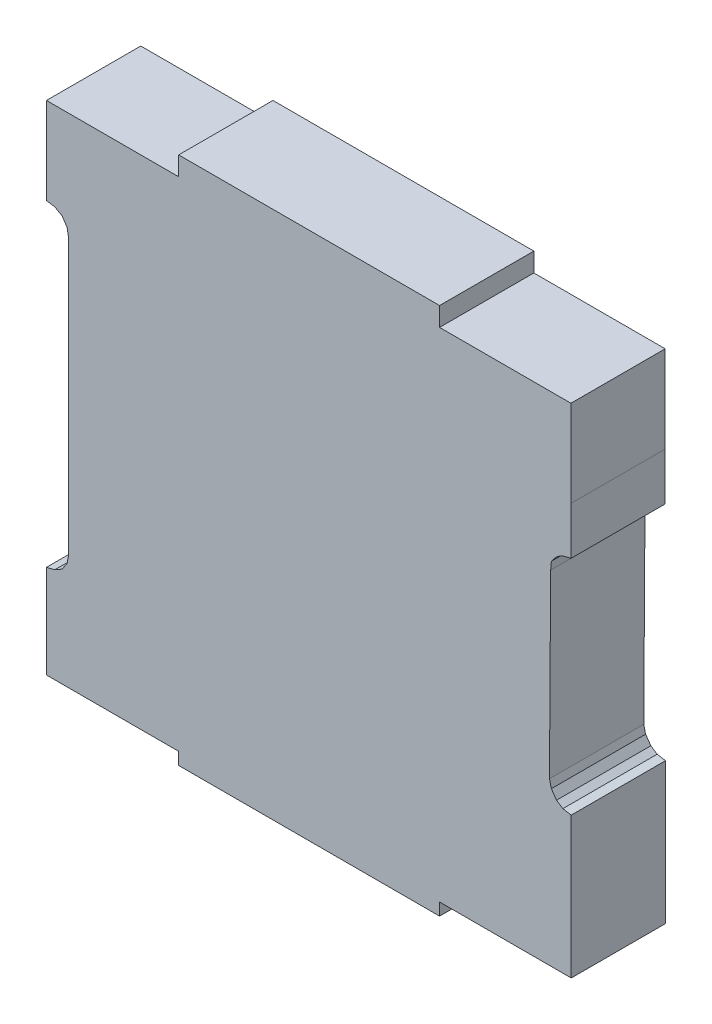
ISO-10303-21;
HEADER;
FILE_DESCRIPTION(('STEP AP214'),'2;1');
FILE_NAME('part.step','',(''),(''),'','','');
FILE_SCHEMA(('AUTOMOTIVE_DESIGN { 1 0 10303 214 1 1 1 1 }'));
ENDSEC;
DATA;
#1=APPLICATION_CONTEXT('core data for automotive mechanical design processes');
#2=APPLICATION_PROTOCOL_DEFINITION('international standard','automotive_design',2000,#1);
#3=PRODUCT_CONTEXT('',#1,'mechanical');
#4=PRODUCT('Part','Part','',(#3));
#5=PRODUCT_RELATED_PRODUCT_CATEGORY('part','',(#4));
#6=PRODUCT_DEFINITION_FORMATION('','',#4);
#7=PRODUCT_DEFINITION_CONTEXT('part definition',#1,'design');
#8=PRODUCT_DEFINITION('design','',#6,#7);
#9=PRODUCT_DEFINITION_SHAPE('','',#8);
#10=(LENGTH_UNIT() NAMED_UNIT(*) SI_UNIT(.MILLI.,.METRE.));
#11=(NAMED_UNIT(*) PLANE_ANGLE_UNIT() SI_UNIT($,.RADIAN.));
#12=(NAMED_UNIT(*) SI_UNIT($,.STERADIAN.) SOLID_ANGLE_UNIT());
#13=UNCERTAINTY_MEASURE_WITH_UNIT(LENGTH_MEASURE(1.E-05),#10,'distance_accuracy_value','');
#14=(GEOMETRIC_REPRESENTATION_CONTEXT(3) GLOBAL_UNCERTAINTY_ASSIGNED_CONTEXT((#13)) GLOBAL_UNIT_ASSIGNED_CONTEXT((#10,
#11,#12)) REPRESENTATION_CONTEXT('',''));
#15=CARTESIAN_POINT('',(0.,0.,0.));
#16=DIRECTION('',(0.,0.,1.));
#17=DIRECTION('',(1.,0.,0.));
#18=AXIS2_PLACEMENT_3D('',#15,#16,#17);
#19=CARTESIAN_POINT('',(0.004072147089888,-0.003966763394403,0.4499991));
#20=DIRECTION('',(0.,0.,-1.));
#21=DIRECTION('',(0.,-1.,0.));
#22=AXIS2_PLACEMENT_3D('',#19,#20,#21);
#23=PLANE('',#22);
#24=DIRECTION('',(0.,1.,0.));
#25=VECTOR('',#24,1.);
#26=CARTESIAN_POINT('',(-1.25230636,0.75731116,0.4499991));
#27=LINE('',#26,#25);
#28=CARTESIAN_POINT('',(-1.25230636,0.75731116,0.4499991));
#29=VERTEX_POINT('',#28);
#30=CARTESIAN_POINT('',(-1.25230636,1.17155214,0.4499991));
#31=VERTEX_POINT('',#30);
#32=EDGE_CURVE('E331',#29,#31,#27,.T.);
#33=ORIENTED_EDGE('',*,*,#32,.F.);
#34=DIRECTION('',(-0.989600074285648,0.143846073890949,0.));
#35=VECTOR('',#34,1.);
#36=CARTESIAN_POINT('',(-1.21269252,0.75155298,0.4499991));
#37=LINE('',#36,#35);
#38=CARTESIAN_POINT('',(-1.21269252,0.75155298,0.4499991));
#39=VERTEX_POINT('',#38);
#40=EDGE_CURVE('E26',#39,#29,#37,.T.);
#41=ORIENTED_EDGE('',*,*,#40,.F.);
#42=DIRECTION('',(-0.868266404406889,0.496098227146936,0.));
#43=VECTOR('',#42,1.);
#44=CARTESIAN_POINT('',(-1.17768878,0.73155302,0.4499991));
#45=LINE('',#44,#43);
#46=CARTESIAN_POINT('',(-1.17768878,0.73155302,0.4499991));
#47=VERTEX_POINT('',#46);
#48=EDGE_CURVE('E363',#47,#39,#45,.T.);
#49=ORIENTED_EDGE('',*,*,#48,.F.);
#50=DIRECTION('',(-0.558445686994025,0.829541086793036,0.));
#51=VECTOR('',#50,1.);
#52=CARTESIAN_POINT('',(-1.15412774,0.69655436,0.4499991));
#53=LINE('',#52,#51);
#54=CARTESIAN_POINT('',(-1.15412774,0.69655436,0.4499991));
#55=VERTEX_POINT('',#54);
#56=EDGE_CURVE('E626',#55,#47,#53,.T.);
#57=ORIENTED_EDGE('',*,*,#56,.F.);
#58=DIRECTION('',(-0.180813600571943,0.983517382585692,0.));
#59=VECTOR('',#58,1.);
#60=CARTESIAN_POINT('',(-1.14702336,0.6579108,0.4499991));
#61=LINE('',#60,#59);
#62=CARTESIAN_POINT('',(-1.14702336,0.6579108,0.4499991));
#63=VERTEX_POINT('',#62);
#64=EDGE_CURVE('E374',#63,#55,#61,.T.);
#65=ORIENTED_EDGE('',*,*,#64,.F.);
#66=DIRECTION('',(-1.73969183810043E-05,0.999999999848674,0.));
#67=VECTOR('',#66,1.);
#68=CARTESIAN_POINT('',(-1.1470005,-0.65611502,0.4499991));
#69=LINE('',#68,#67);
#70=CARTESIAN_POINT('',(-1.1470005,-0.65611502,0.4499991));
#71=VERTEX_POINT('',#70);
#72=EDGE_CURVE('E834',#71,#63,#69,.T.);
#73=ORIENTED_EDGE('',*,*,#72,.F.);
#74=DIRECTION('',(0.187535908039033,0.982257747842172,0.));
#75=VECTOR('',#74,1.);
#76=CARTESIAN_POINT('',(-1.15412774,-0.6934454,0.4499991));
#77=LINE('',#76,#75);
#78=CARTESIAN_POINT('',(-1.15412774,-0.6934454,0.4499991));
#79=VERTEX_POINT('',#78);
#80=EDGE_CURVE('E406',#79,#71,#77,.T.);
#81=ORIENTED_EDGE('',*,*,#80,.F.);
#82=DIRECTION('',(0.558431338237087,0.829550746172129,0.));
#83=VECTOR('',#82,1.);
#84=CARTESIAN_POINT('',(-1.17769132,-0.72844914,0.4499991));
#85=LINE('',#84,#83);
#86=CARTESIAN_POINT('',(-1.17769132,-0.72844914,0.4499991));
#87=VERTEX_POINT('',#86);
#88=EDGE_CURVE('E476',#87,#79,#85,.T.);
#89=ORIENTED_EDGE('',*,*,#88,.F.);
#90=DIRECTION('',(0.868278037832248,0.496077865882142,0.));
#91=VECTOR('',#90,1.);
#92=CARTESIAN_POINT('',(-1.21269252,-0.74844656,0.4499991));
#93=LINE('',#92,#91);
#94=CARTESIAN_POINT('',(-1.21269252,-0.74844656,0.4499991));
#95=VERTEX_POINT('',#94);
#96=EDGE_CURVE('E289',#95,#87,#93,.T.);
#97=ORIENTED_EDGE('',*,*,#96,.F.);
#98=DIRECTION('',(0.971000649625599,0.239076846278901,0.));
#99=VECTOR('',#98,1.);
#100=CARTESIAN_POINT('',(-1.25230636,-0.75820016,0.4499991));
#101=LINE('',#100,#99);
#102=CARTESIAN_POINT('',(-1.25230636,-0.75820016,0.4499991));
#103=VERTEX_POINT('',#102);
#104=EDGE_CURVE('E282',#103,#95,#101,.T.);
#105=ORIENTED_EDGE('',*,*,#104,.F.);
#106=DIRECTION('',(0.,1.,0.));
#107=VECTOR('',#106,1.);
#108=CARTESIAN_POINT('',(-1.25230636,-1.20344692,0.4499991));
#109=LINE('',#108,#107);
#110=CARTESIAN_POINT('',(-1.25230636,-1.20344692,0.4499991));
#111=VERTEX_POINT('',#110);
#112=EDGE_CURVE('E286',#111,#103,#109,.T.);
#113=ORIENTED_EDGE('',*,*,#112,.F.);
#114=DIRECTION('',(-1.,0.,0.));
#115=VECTOR('',#114,1.);
#116=CARTESIAN_POINT('',(-0.6213221,-1.20344692,0.4499991));
#117=LINE('',#116,#115);
#118=CARTESIAN_POINT('',(-0.6213221,-1.20344692,0.4499991));
#119=VERTEX_POINT('',#118);
#120=EDGE_CURVE('E375',#119,#111,#117,.T.);
#121=ORIENTED_EDGE('',*,*,#120,.F.);
#122=DIRECTION('',(0.,1.,0.));
#123=VECTOR('',#122,1.);
#124=CARTESIAN_POINT('',(-0.6213221,-1.26197106,0.4499991));
#125=LINE('',#124,#123);
#126=CARTESIAN_POINT('',(-0.6213221,-1.26197106,0.4499991));
#127=VERTEX_POINT('',#126);
#128=EDGE_CURVE('E458',#127,#119,#125,.T.);
#129=ORIENTED_EDGE('',*,*,#128,.F.);
#130=DIRECTION('',(-1.,0.,0.));
#131=VECTOR('',#130,1.);
#132=CARTESIAN_POINT('',(0.62387988,-1.26197106,0.4499991));
#133=LINE('',#132,#131);
#134=CARTESIAN_POINT('',(0.62387988,-1.26197106,0.4499991));
#135=VERTEX_POINT('',#134);
#136=EDGE_CURVE('E347',#135,#127,#133,.T.);
#137=ORIENTED_EDGE('',*,*,#136,.F.);
#138=DIRECTION('',(0.,-1.,0.));
#139=VECTOR('',#138,1.);
#140=CARTESIAN_POINT('',(0.62387988,-1.20344692,0.4499991));
#141=LINE('',#140,#139);
#142=CARTESIAN_POINT('',(0.62387988,-1.20344692,0.4499991));
#143=VERTEX_POINT('',#142);
#144=EDGE_CURVE('E541',#143,#135,#141,.T.);
#145=ORIENTED_EDGE('',*,*,#144,.F.);
#146=DIRECTION('',(-1.,0.,0.));
#147=VECTOR('',#146,1.);
#148=CARTESIAN_POINT('',(1.2523089,-1.20344692,0.4499991));
#149=LINE('',#148,#147);
#150=CARTESIAN_POINT('',(1.2523089,-1.20344692,0.4499991));
#151=VERTEX_POINT('',#150);
#152=EDGE_CURVE('E426',#151,#143,#149,.T.);
#153=ORIENTED_EDGE('',*,*,#152,.F.);
#154=DIRECTION('',(0.,-1.,0.));
#155=VECTOR('',#154,1.);
#156=CARTESIAN_POINT('',(1.2523089,-0.53015388,0.4499991));
#157=LINE('',#156,#155);
#158=CARTESIAN_POINT('',(1.2523089,-0.53015388,0.4499991));
#159=VERTEX_POINT('',#158);
#160=EDGE_CURVE('E470',#159,#151,#157,.T.);
#161=ORIENTED_EDGE('',*,*,#160,.F.);
#162=DIRECTION('',(0.986227548607137,-0.165394142485023,0.));
#163=VECTOR('',#162,1.);
#164=CARTESIAN_POINT('',(1.21230898,-0.52344574,0.4499991));
#165=LINE('',#164,#163);
#166=CARTESIAN_POINT('',(1.21230898,-0.52344574,0.4499991));
#167=VERTEX_POINT('',#166);
#168=EDGE_CURVE('E388',#167,#159,#165,.T.);
#169=ORIENTED_EDGE('',*,*,#168,.F.);
#170=DIRECTION('',(0.832050294337228,-0.554700196226152,0.));
#171=VECTOR('',#170,1.);
#172=CARTESIAN_POINT('',(1.18230904,-0.50344578,0.4499991));
#173=LINE('',#172,#171);
#174=CARTESIAN_POINT('',(1.18230904,-0.50344578,0.4499991));
#175=VERTEX_POINT('',#174);
#176=EDGE_CURVE('E453',#175,#167,#173,.T.);
#177=ORIENTED_EDGE('',*,*,#176,.F.);
#178=DIRECTION('',(0.58064041417209,-0.814160125178127,0.));
#179=VECTOR('',#178,1.);
#180=CARTESIAN_POINT('',(1.15733068,-0.46842172,0.4499991));
#181=LINE('',#180,#179);
#182=CARTESIAN_POINT('',(1.15733068,-0.46842172,0.4499991));
#183=VERTEX_POINT('',#182);
#184=EDGE_CURVE('E575',#183,#175,#181,.T.);
#185=ORIENTED_EDGE('',*,*,#184,.F.);
#186=DIRECTION('',(0.237317060096085,-0.971432248274346,0.));
#187=VECTOR('',#186,1.);
#188=CARTESIAN_POINT('',(1.1484102,-0.43190668,0.4499991));
#189=LINE('',#188,#187);
#190=CARTESIAN_POINT('',(1.1484102,-0.43190668,0.4499991));
#191=VERTEX_POINT('',#190);
#192=EDGE_CURVE('E432',#191,#183,#189,.T.);
#193=ORIENTED_EDGE('',*,*,#192,.F.);
#194=DIRECTION('',(-0.00650451927293341,-0.999978845390755,0.));
#195=VECTOR('',#194,1.);
#196=CARTESIAN_POINT('',(1.15403884,0.43341798,0.4499991));
#197=LINE('',#196,#195);
#198=CARTESIAN_POINT('',(1.15403884,0.43341798,0.4499991));
#199=VERTEX_POINT('',#198);
#200=EDGE_CURVE('E481',#199,#191,#197,.T.);
#201=ORIENTED_EDGE('',*,*,#200,.F.);
#202=DIRECTION('',(-0.085401141345704,-0.996346649041814,0.));
#203=VECTOR('',#202,1.);
#204=CARTESIAN_POINT('',(1.15730782,0.47155608,0.4499991));
#205=LINE('',#204,#203);
#206=CARTESIAN_POINT('',(1.15730782,0.47155608,0.4499991));
#207=VERTEX_POINT('',#206);
#208=EDGE_CURVE('E525',#207,#199,#205,.T.);
#209=ORIENTED_EDGE('',*,*,#208,.F.);
#210=DIRECTION('',(-0.600081281194105,-0.79993903265214,0.));
#211=VECTOR('',#210,1.);
#212=CARTESIAN_POINT('',(1.17230906,0.4915535,0.4499991));
#213=LINE('',#212,#211);
#214=CARTESIAN_POINT('',(1.17230906,0.4915535,0.4499991));
#215=VERTEX_POINT('',#214);
#216=EDGE_CURVE('E321',#215,#207,#213,.T.);
#217=ORIENTED_EDGE('',*,*,#216,.F.);
#218=DIRECTION('',(-0.707106781188048,-0.707106781185048,0.));
#219=VECTOR('',#218,1.);
#220=CARTESIAN_POINT('',(1.18730776,0.5065522,0.4499991));
#221=LINE('',#220,#219);
#222=CARTESIAN_POINT('',(1.18730776,0.5065522,0.4499991));
#223=VERTEX_POINT('',#222);
#224=EDGE_CURVE('E540',#223,#215,#221,.T.);
#225=ORIENTED_EDGE('',*,*,#224,.F.);
#226=DIRECTION('',(-0.857485238888372,-0.514508566584223,0.));
#227=VECTOR('',#226,1.);
#228=CARTESIAN_POINT('',(1.21230898,0.52155344,0.4499991));
#229=LINE('',#228,#227);
#230=CARTESIAN_POINT('',(1.21230898,0.52155344,0.4499991));
#231=VERTEX_POINT('',#230);
#232=EDGE_CURVE('E337',#231,#223,#229,.T.);
#233=ORIENTED_EDGE('',*,*,#232,.F.);
#234=DIRECTION('',(-0.975978770667956,-0.21786564484899,0.));
#235=VECTOR('',#234,1.);
#236=CARTESIAN_POINT('',(1.25075696,0.5301361,0.4499991));
#237=LINE('',#236,#235);
#238=CARTESIAN_POINT('',(1.25075696,0.5301361,0.4499991));
#239=VERTEX_POINT('',#238);
#240=EDGE_CURVE('E408',#239,#231,#237,.T.);
#241=ORIENTED_EDGE('',*,*,#240,.F.);
#242=DIRECTION('',(0.,-1.,0.));
#243=VECTOR('',#242,1.);
#244=CARTESIAN_POINT('',(1.25075696,0.75731116,0.4499991));
#245=LINE('',#244,#243);
#246=CARTESIAN_POINT('',(1.25075696,0.75731116,0.4499991));
#247=VERTEX_POINT('',#246);
#248=EDGE_CURVE('E599',#247,#239,#245,.T.);
#249=ORIENTED_EDGE('',*,*,#248,.F.);
#250=DIRECTION('',(0.,-1.,0.));
#251=VECTOR('',#250,1.);
#252=CARTESIAN_POINT('',(1.25075696,1.17155214,0.4499991));
#253=LINE('',#252,#251);
#254=CARTESIAN_POINT('',(1.25075696,1.17155214,0.4499991));
#255=VERTEX_POINT('',#254);
#256=EDGE_CURVE('E610',#255,#247,#253,.T.);
#257=ORIENTED_EDGE('',*,*,#256,.F.);
#258=DIRECTION('',(1.,0.,0.));
#259=VECTOR('',#258,1.);
#260=CARTESIAN_POINT('',(0.62387988,1.17155214,0.4499991));
#261=LINE('',#260,#259);
#262=CARTESIAN_POINT('',(0.62387988,1.17155214,0.4499991));
#263=VERTEX_POINT('',#262);
#264=EDGE_CURVE('E491',#263,#255,#261,.T.);
#265=ORIENTED_EDGE('',*,*,#264,.F.);
#266=DIRECTION('',(0.,-1.,0.));
#267=VECTOR('',#266,1.);
#268=CARTESIAN_POINT('',(0.62387988,1.2619736,0.4499991));
#269=LINE('',#268,#267);
#270=CARTESIAN_POINT('',(0.62387988,1.2619736,0.4499991));
#271=VERTEX_POINT('',#270);
#272=EDGE_CURVE('E447',#271,#263,#269,.T.);
#273=ORIENTED_EDGE('',*,*,#272,.F.);
#274=DIRECTION('',(1.,0.,0.));
#275=VECTOR('',#274,1.);
#276=CARTESIAN_POINT('',(-0.62132464,1.2619736,0.4499991));
#277=LINE('',#276,#275);
#278=CARTESIAN_POINT('',(-0.62132464,1.2619736,0.4499991));
#279=VERTEX_POINT('',#278);
#280=EDGE_CURVE('E381',#279,#271,#277,.T.);
#281=ORIENTED_EDGE('',*,*,#280,.F.);
#282=DIRECTION('',(-2.80906769744628E-05,0.999999999605457,0.));
#283=VECTOR('',#282,1.);
#284=CARTESIAN_POINT('',(-0.6213221,1.17155214,0.4499991));
#285=LINE('',#284,#283);
#286=CARTESIAN_POINT('',(-0.6213221,1.17155214,0.4499991));
#287=VERTEX_POINT('',#286);
#288=EDGE_CURVE('E354',#287,#279,#285,.T.);
#289=ORIENTED_EDGE('',*,*,#288,.F.);
#290=DIRECTION('',(1.,0.,0.));
#291=VECTOR('',#290,1.);
#292=CARTESIAN_POINT('',(-1.25230636,1.17155214,0.4499991));
#293=LINE('',#292,#291);
#294=EDGE_CURVE('E382',#31,#287,#293,.T.);
#295=ORIENTED_EDGE('',*,*,#294,.F.);
#296=EDGE_LOOP('',(#33,#41,#49,#57,#65,#73,#81,#89,#97,#105,#113,#121,#129,#137,#145,#153,#161,
#169,#177,#185,#193,#201,#209,#217,#225,#233,#241,#249,#257,#265,#273,#281,#289,#295));
#297=FACE_BOUND('',#296,.T.);
#298=ADVANCED_FACE('F16',(#297),#23,.F.);
#299=CARTESIAN_POINT('',(0.004072147089888,-0.003966763394403,0.));
#300=DIRECTION('',(0.,0.,-1.));
#301=DIRECTION('',(0.,-1.,0.));
#302=AXIS2_PLACEMENT_3D('',#299,#300,#301);
#303=PLANE('',#302);
#304=DIRECTION('',(0.,1.,0.));
#305=VECTOR('',#304,1.);
#306=CARTESIAN_POINT('',(-1.25230636,0.75731116,0.));
#307=LINE('',#306,#305);
#308=CARTESIAN_POINT('',(-1.25230636,0.75731116,0.));
#309=VERTEX_POINT('',#308);
#310=CARTESIAN_POINT('',(-1.25230636,1.17155214,0.));
#311=VERTEX_POINT('',#310);
#312=EDGE_CURVE('E387',#309,#311,#307,.T.);
#313=ORIENTED_EDGE('',*,*,#312,.T.);
#314=DIRECTION('',(1.,0.,0.));
#315=VECTOR('',#314,1.);
#316=CARTESIAN_POINT('',(-1.25230636,1.17155214,0.));
#317=LINE('',#316,#315);
#318=CARTESIAN_POINT('',(-0.6213221,1.17155214,0.));
#319=VERTEX_POINT('',#318);
#320=EDGE_CURVE('E442',#311,#319,#317,.T.);
#321=ORIENTED_EDGE('',*,*,#320,.T.);
#322=DIRECTION('',(-2.80906769744628E-05,0.999999999605457,0.));
#323=VECTOR('',#322,1.);
#324=CARTESIAN_POINT('',(-0.6213221,1.17155214,0.));
#325=LINE('',#324,#323);
#326=CARTESIAN_POINT('',(-0.62132464,1.2619736,0.));
#327=VERTEX_POINT('',#326);
#328=EDGE_CURVE('E353',#319,#327,#325,.T.);
#329=ORIENTED_EDGE('',*,*,#328,.T.);
#330=DIRECTION('',(1.,0.,0.));
#331=VECTOR('',#330,1.);
#332=CARTESIAN_POINT('',(-0.62132464,1.2619736,0.));
#333=LINE('',#332,#331);
#334=CARTESIAN_POINT('',(0.62387988,1.2619736,0.));
#335=VERTEX_POINT('',#334);
#336=EDGE_CURVE('E443',#327,#335,#333,.T.);
#337=ORIENTED_EDGE('',*,*,#336,.T.);
#338=DIRECTION('',(0.,-1.,0.));
#339=VECTOR('',#338,1.);
#340=CARTESIAN_POINT('',(0.62387988,1.2619736,0.));
#341=LINE('',#340,#339);
#342=CARTESIAN_POINT('',(0.62387988,1.17155214,0.));
#343=VERTEX_POINT('',#342);
#344=EDGE_CURVE('E487',#335,#343,#341,.T.);
#345=ORIENTED_EDGE('',*,*,#344,.T.);
#346=DIRECTION('',(1.,0.,0.));
#347=VECTOR('',#346,1.);
#348=CARTESIAN_POINT('',(0.62387988,1.17155214,0.));
#349=LINE('',#348,#347);
#350=CARTESIAN_POINT('',(1.25075696,1.17155214,0.));
#351=VERTEX_POINT('',#350);
#352=EDGE_CURVE('E511',#343,#351,#349,.T.);
#353=ORIENTED_EDGE('',*,*,#352,.T.);
#354=DIRECTION('',(0.,-1.,0.));
#355=VECTOR('',#354,1.);
#356=CARTESIAN_POINT('',(1.25075696,1.17155214,0.));
#357=LINE('',#356,#355);
#358=CARTESIAN_POINT('',(1.25075696,0.75731116,0.));
#359=VERTEX_POINT('',#358);
#360=EDGE_CURVE('E603',#351,#359,#357,.T.);
#361=ORIENTED_EDGE('',*,*,#360,.T.);
#362=DIRECTION('',(0.,-1.,0.));
#363=VECTOR('',#362,1.);
#364=CARTESIAN_POINT('',(1.25075696,0.75731116,0.));
#365=LINE('',#364,#363);
#366=CARTESIAN_POINT('',(1.25075696,0.5301361,0.));
#367=VERTEX_POINT('',#366);
#368=EDGE_CURVE('E412',#359,#367,#365,.T.);
#369=ORIENTED_EDGE('',*,*,#368,.T.);
#370=DIRECTION('',(-0.975978770667956,-0.21786564484899,0.));
#371=VECTOR('',#370,1.);
#372=CARTESIAN_POINT('',(1.25075696,0.5301361,0.));
#373=LINE('',#372,#371);
#374=CARTESIAN_POINT('',(1.21230898,0.52155344,0.));
#375=VERTEX_POINT('',#374);
#376=EDGE_CURVE('E338',#367,#375,#373,.T.);
#377=ORIENTED_EDGE('',*,*,#376,.T.);
#378=DIRECTION('',(-0.857485238888372,-0.514508566584223,0.));
#379=VECTOR('',#378,1.);
#380=CARTESIAN_POINT('',(1.21230898,0.52155344,0.));
#381=LINE('',#380,#379);
#382=CARTESIAN_POINT('',(1.18730776,0.5065522,0.));
#383=VERTEX_POINT('',#382);
#384=EDGE_CURVE('E336',#375,#383,#381,.T.);
#385=ORIENTED_EDGE('',*,*,#384,.T.);
#386=DIRECTION('',(-0.707106781188048,-0.707106781185048,0.));
#387=VECTOR('',#386,1.);
#388=CARTESIAN_POINT('',(1.18730776,0.5065522,0.));
#389=LINE('',#388,#387);
#390=CARTESIAN_POINT('',(1.17230906,0.4915535,0.));
#391=VERTEX_POINT('',#390);
#392=EDGE_CURVE('E326',#383,#391,#389,.T.);
#393=ORIENTED_EDGE('',*,*,#392,.T.);
#394=DIRECTION('',(-0.600081281194105,-0.79993903265214,0.));
#395=VECTOR('',#394,1.);
#396=CARTESIAN_POINT('',(1.17230906,0.4915535,0.));
#397=LINE('',#396,#395);
#398=CARTESIAN_POINT('',(1.15730782,0.47155608,0.));
#399=VERTEX_POINT('',#398);
#400=EDGE_CURVE('E529',#391,#399,#397,.T.);
#401=ORIENTED_EDGE('',*,*,#400,.T.);
#402=DIRECTION('',(-0.085401141345704,-0.996346649041814,0.));
#403=VECTOR('',#402,1.);
#404=CARTESIAN_POINT('',(1.15730782,0.47155608,0.));
#405=LINE('',#404,#403);
#406=CARTESIAN_POINT('',(1.15403884,0.43341798,0.));
#407=VERTEX_POINT('',#406);
#408=EDGE_CURVE('E477',#399,#407,#405,.T.);
#409=ORIENTED_EDGE('',*,*,#408,.T.);
#410=DIRECTION('',(-0.00650451927293341,-0.999978845390755,0.));
#411=VECTOR('',#410,1.);
#412=CARTESIAN_POINT('',(1.15403884,0.43341798,0.));
#413=LINE('',#412,#411);
#414=CARTESIAN_POINT('',(1.1484102,-0.43190668,0.));
#415=VERTEX_POINT('',#414);
#416=EDGE_CURVE('E428',#407,#415,#413,.T.);
#417=ORIENTED_EDGE('',*,*,#416,.T.);
#418=DIRECTION('',(0.237317060096085,-0.971432248274346,0.));
#419=VECTOR('',#418,1.);
#420=CARTESIAN_POINT('',(1.1484102,-0.43190668,0.));
#421=LINE('',#420,#419);
#422=CARTESIAN_POINT('',(1.15733068,-0.46842172,0.));
#423=VERTEX_POINT('',#422);
#424=EDGE_CURVE('E506',#415,#423,#421,.T.);
#425=ORIENTED_EDGE('',*,*,#424,.T.);
#426=DIRECTION('',(0.58064041417209,-0.814160125178127,0.));
#427=VECTOR('',#426,1.);
#428=CARTESIAN_POINT('',(1.15733068,-0.46842172,0.));
#429=LINE('',#428,#427);
#430=CARTESIAN_POINT('',(1.18230904,-0.50344578,0.));
#431=VERTEX_POINT('',#430);
#432=EDGE_CURVE('E449',#423,#431,#429,.T.);
#433=ORIENTED_EDGE('',*,*,#432,.T.);
#434=DIRECTION('',(0.832050294337228,-0.554700196226152,0.));
#435=VECTOR('',#434,1.);
#436=CARTESIAN_POINT('',(1.18230904,-0.50344578,0.));
#437=LINE('',#436,#435);
#438=CARTESIAN_POINT('',(1.21230898,-0.52344574,0.));
#439=VERTEX_POINT('',#438);
#440=EDGE_CURVE('E393',#431,#439,#437,.T.);
#441=ORIENTED_EDGE('',*,*,#440,.T.);
#442=DIRECTION('',(0.986227548607137,-0.165394142485023,0.));
#443=VECTOR('',#442,1.);
#444=CARTESIAN_POINT('',(1.21230898,-0.52344574,0.));
#445=LINE('',#444,#443);
#446=CARTESIAN_POINT('',(1.2523089,-0.53015388,0.));
#447=VERTEX_POINT('',#446);
#448=EDGE_CURVE('E595',#439,#447,#445,.T.);
#449=ORIENTED_EDGE('',*,*,#448,.T.);
#450=DIRECTION('',(0.,-1.,0.));
#451=VECTOR('',#450,1.);
#452=CARTESIAN_POINT('',(1.2523089,-0.53015388,0.));
#453=LINE('',#452,#451);
#454=CARTESIAN_POINT('',(1.2523089,-1.20344692,0.));
#455=VERTEX_POINT('',#454);
#456=EDGE_CURVE('E422',#447,#455,#453,.T.);
#457=ORIENTED_EDGE('',*,*,#456,.T.);
#458=DIRECTION('',(-1.,0.,0.));
#459=VECTOR('',#458,1.);
#460=CARTESIAN_POINT('',(1.2523089,-1.20344692,0.));
#461=LINE('',#460,#459);
#462=CARTESIAN_POINT('',(0.62387988,-1.20344692,0.));
#463=VERTEX_POINT('',#462);
#464=EDGE_CURVE('E499',#455,#463,#461,.T.);
#465=ORIENTED_EDGE('',*,*,#464,.T.);
#466=DIRECTION('',(0.,-1.,0.));
#467=VECTOR('',#466,1.);
#468=CARTESIAN_POINT('',(0.62387988,-1.20344692,0.));
#469=LINE('',#468,#467);
#470=CARTESIAN_POINT('',(0.62387988,-1.26197106,0.));
#471=VERTEX_POINT('',#470);
#472=EDGE_CURVE('E343',#463,#471,#469,.T.);
#473=ORIENTED_EDGE('',*,*,#472,.T.);
#474=DIRECTION('',(-1.,0.,0.));
#475=VECTOR('',#474,1.);
#476=CARTESIAN_POINT('',(0.62387988,-1.26197106,0.));
#477=LINE('',#476,#475);
#478=CARTESIAN_POINT('',(-0.6213221,-1.26197106,0.));
#479=VERTEX_POINT('',#478);
#480=EDGE_CURVE('E455',#471,#479,#477,.T.);
#481=ORIENTED_EDGE('',*,*,#480,.T.);
#482=DIRECTION('',(0.,1.,0.));
#483=VECTOR('',#482,1.);
#484=CARTESIAN_POINT('',(-0.6213221,-1.26197106,0.));
#485=LINE('',#484,#483);
#486=CARTESIAN_POINT('',(-0.6213221,-1.20344692,0.));
#487=VERTEX_POINT('',#486);
#488=EDGE_CURVE('E19',#479,#487,#485,.T.);
#489=ORIENTED_EDGE('',*,*,#488,.T.);
#490=DIRECTION('',(-1.,0.,0.));
#491=VECTOR('',#490,1.);
#492=CARTESIAN_POINT('',(-0.6213221,-1.20344692,0.));
#493=LINE('',#492,#491);
#494=CARTESIAN_POINT('',(-1.25230636,-1.20344692,0.));
#495=VERTEX_POINT('',#494);
#496=EDGE_CURVE('E311',#487,#495,#493,.T.);
#497=ORIENTED_EDGE('',*,*,#496,.T.);
#498=DIRECTION('',(0.,1.,0.));
#499=VECTOR('',#498,1.);
#500=CARTESIAN_POINT('',(-1.25230636,-1.20344692,0.));
#501=LINE('',#500,#499);
#502=CARTESIAN_POINT('',(-1.25230636,-0.75820016,0.));
#503=VERTEX_POINT('',#502);
#504=EDGE_CURVE('E295',#495,#503,#501,.T.);
#505=ORIENTED_EDGE('',*,*,#504,.T.);
#506=DIRECTION('',(0.971000649625599,0.239076846278901,0.));
#507=VECTOR('',#506,1.);
#508=CARTESIAN_POINT('',(-1.25230636,-0.75820016,0.));
#509=LINE('',#508,#507);
#510=CARTESIAN_POINT('',(-1.21269252,-0.74844656,0.));
#511=VERTEX_POINT('',#510);
#512=EDGE_CURVE('E301',#503,#511,#509,.T.);
#513=ORIENTED_EDGE('',*,*,#512,.T.);
#514=DIRECTION('',(0.868278037832248,0.496077865882142,0.));
#515=VECTOR('',#514,1.);
#516=CARTESIAN_POINT('',(-1.21269252,-0.74844656,0.));
#517=LINE('',#516,#515);
#518=CARTESIAN_POINT('',(-1.17769132,-0.72844914,0.));
#519=VERTEX_POINT('',#518);
#520=EDGE_CURVE('E359',#511,#519,#517,.T.);
#521=ORIENTED_EDGE('',*,*,#520,.T.);
#522=DIRECTION('',(0.558431338237087,0.829550746172129,0.));
#523=VECTOR('',#522,1.);
#524=CARTESIAN_POINT('',(-1.17769132,-0.72844914,0.));
#525=LINE('',#524,#523);
#526=CARTESIAN_POINT('',(-1.15412774,-0.6934454,0.));
#527=VERTEX_POINT('',#526);
#528=EDGE_CURVE('E402',#519,#527,#525,.T.);
#529=ORIENTED_EDGE('',*,*,#528,.T.);
#530=DIRECTION('',(0.187535908039033,0.982257747842172,0.));
#531=VECTOR('',#530,1.);
#532=CARTESIAN_POINT('',(-1.15412774,-0.6934454,0.));
#533=LINE('',#532,#531);
#534=CARTESIAN_POINT('',(-1.1470005,-0.65611502,0.));
#535=VERTEX_POINT('',#534);
#536=EDGE_CURVE('E524',#527,#535,#533,.T.);
#537=ORIENTED_EDGE('',*,*,#536,.T.);
#538=DIRECTION('',(-1.73969183810043E-05,0.999999999848674,0.));
#539=VECTOR('',#538,1.);
#540=CARTESIAN_POINT('',(-1.1470005,-0.65611502,0.));
#541=LINE('',#540,#539);
#542=CARTESIAN_POINT('',(-1.14702336,0.6579108,0.));
#543=VERTEX_POINT('',#542);
#544=EDGE_CURVE('E413',#535,#543,#541,.T.);
#545=ORIENTED_EDGE('',*,*,#544,.T.);
#546=DIRECTION('',(-0.180813600571943,0.983517382585692,0.));
#547=VECTOR('',#546,1.);
#548=CARTESIAN_POINT('',(-1.14702336,0.6579108,0.));
#549=LINE('',#548,#547);
#550=CARTESIAN_POINT('',(-1.15412774,0.69655436,0.));
#551=VERTEX_POINT('',#550);
#552=EDGE_CURVE('E373',#543,#551,#549,.T.);
#553=ORIENTED_EDGE('',*,*,#552,.T.);
#554=DIRECTION('',(-0.558445686994025,0.829541086793036,0.));
#555=VECTOR('',#554,1.);
#556=CARTESIAN_POINT('',(-1.15412774,0.69655436,0.));
#557=LINE('',#556,#555);
#558=CARTESIAN_POINT('',(-1.17768878,0.73155302,0.));
#559=VERTEX_POINT('',#558);
#560=EDGE_CURVE('E368',#551,#559,#557,.T.);
#561=ORIENTED_EDGE('',*,*,#560,.T.);
#562=DIRECTION('',(-0.868266404406889,0.496098227146936,0.));
#563=VECTOR('',#562,1.);
#564=CARTESIAN_POINT('',(-1.17768878,0.73155302,0.));
#565=LINE('',#564,#563);
#566=CARTESIAN_POINT('',(-1.21269252,0.75155298,0.));
#567=VERTEX_POINT('',#566);
#568=EDGE_CURVE('E434',#559,#567,#565,.T.);
#569=ORIENTED_EDGE('',*,*,#568,.T.);
#570=DIRECTION('',(-0.989600074285648,0.143846073890949,0.));
#571=VECTOR('',#570,1.);
#572=CARTESIAN_POINT('',(-1.21269252,0.75155298,0.));
#573=LINE('',#572,#571);
#574=EDGE_CURVE('E11',#567,#309,#573,.T.);
#575=ORIENTED_EDGE('',*,*,#574,.T.);
#576=EDGE_LOOP('',(#313,#321,#329,#337,#345,#353,#361,#369,#377,#385,#393,#401,#409,#417,#425,
#433,#441,#449,#457,#465,#473,#481,#489,#497,#505,#513,#521,#529,#537,#545,#553,#561,#569,#575));
#577=FACE_BOUND('',#576,.T.);
#578=ADVANCED_FACE('F913',(#577),#303,.T.);
#579=CARTESIAN_POINT('',(-1.21269252,0.75155298,0.));
#580=DIRECTION('',(-0.143846073890949,-0.989600074285648,0.));
#581=DIRECTION('',(-0.989600074285648,0.143846073890949,0.));
#582=AXIS2_PLACEMENT_3D('',#579,#580,#581);
#583=PLANE('',#582);
#584=DIRECTION('',(0.,0.,1.));
#585=VECTOR('',#584,1.);
#586=CARTESIAN_POINT('',(-1.21269252,0.75155298,0.));
#587=LINE('',#586,#585);
#588=EDGE_CURVE('E367',#567,#39,#587,.T.);
#589=ORIENTED_EDGE('',*,*,#588,.T.);
#590=ORIENTED_EDGE('',*,*,#40,.T.);
#591=DIRECTION('',(0.,0.,1.));
#592=VECTOR('',#591,1.);
#593=CARTESIAN_POINT('',(-1.25230636,0.75731116,0.));
#594=LINE('',#593,#592);
#595=EDGE_CURVE('E327',#309,#29,#594,.T.);
#596=ORIENTED_EDGE('',*,*,#595,.F.);
#597=ORIENTED_EDGE('',*,*,#574,.F.);
#598=EDGE_LOOP('',(#589,#590,#596,#597));
#599=FACE_BOUND('',#598,.T.);
#600=ADVANCED_FACE('F955',(#599),#583,.T.);
#601=CARTESIAN_POINT('',(-1.17768878,0.73155302,0.));
#602=DIRECTION('',(-0.496098227146936,-0.868266404406889,0.));
#603=DIRECTION('',(-0.868266404406889,0.496098227146936,0.));
#604=AXIS2_PLACEMENT_3D('',#601,#602,#603);
#605=PLANE('',#604);
#606=DIRECTION('',(0.,0.,1.));
#607=VECTOR('',#606,1.);
#608=CARTESIAN_POINT('',(-1.17768878,0.73155302,0.));
#609=LINE('',#608,#607);
#610=EDGE_CURVE('E401',#559,#47,#609,.T.);
#611=ORIENTED_EDGE('',*,*,#610,.T.);
#612=ORIENTED_EDGE('',*,*,#48,.T.);
#613=ORIENTED_EDGE('',*,*,#588,.F.);
#614=ORIENTED_EDGE('',*,*,#568,.F.);
#615=EDGE_LOOP('',(#611,#612,#613,#614));
#616=FACE_BOUND('',#615,.T.);
#617=ADVANCED_FACE('F957',(#616),#605,.T.);
#618=CARTESIAN_POINT('',(-1.15412774,0.69655436,0.));
#619=DIRECTION('',(-0.829541086793036,-0.558445686994025,0.));
#620=DIRECTION('',(-0.558445686994025,0.829541086793036,0.));
#621=AXIS2_PLACEMENT_3D('',#618,#619,#620);
#622=PLANE('',#621);
#623=DIRECTION('',(0.,0.,1.));
#624=VECTOR('',#623,1.);
#625=CARTESIAN_POINT('',(-1.15412774,0.69655436,0.));
#626=LINE('',#625,#624);
#627=EDGE_CURVE('E369',#551,#55,#626,.T.);
#628=ORIENTED_EDGE('',*,*,#627,.T.);
#629=ORIENTED_EDGE('',*,*,#56,.T.);
#630=ORIENTED_EDGE('',*,*,#610,.F.);
#631=ORIENTED_EDGE('',*,*,#560,.F.);
#632=EDGE_LOOP('',(#628,#629,#630,#631));
#633=FACE_BOUND('',#632,.T.);
#634=ADVANCED_FACE('F982',(#633),#622,.T.);
#635=CARTESIAN_POINT('',(-1.14702336,0.6579108,0.));
#636=DIRECTION('',(-0.983517382585692,-0.180813600571943,0.));
#637=DIRECTION('',(-0.180813600571943,0.983517382585692,0.));
#638=AXIS2_PLACEMENT_3D('',#635,#636,#637);
#639=PLANE('',#638);
#640=DIRECTION('',(0.,0.,1.));
#641=VECTOR('',#640,1.);
#642=CARTESIAN_POINT('',(-1.14702336,0.6579108,0.));
#643=LINE('',#642,#641);
#644=EDGE_CURVE('E417',#543,#63,#643,.T.);
#645=ORIENTED_EDGE('',*,*,#644,.T.);
#646=ORIENTED_EDGE('',*,*,#64,.T.);
#647=ORIENTED_EDGE('',*,*,#627,.F.);
#648=ORIENTED_EDGE('',*,*,#552,.F.);
#649=EDGE_LOOP('',(#645,#646,#647,#648));
#650=FACE_BOUND('',#649,.T.);
#651=ADVANCED_FACE('F984',(#650),#639,.T.);
#652=CARTESIAN_POINT('',(-1.1470005,-0.65611502,0.));
#653=DIRECTION('',(-0.999999999848674,-1.73969183810043E-05,0.));
#654=DIRECTION('',(-1.73969183810043E-05,0.999999999848674,0.));
#655=AXIS2_PLACEMENT_3D('',#652,#653,#654);
#656=PLANE('',#655);
#657=DIRECTION('',(0.,0.,1.));
#658=VECTOR('',#657,1.);
#659=CARTESIAN_POINT('',(-1.1470005,-0.65611502,0.));
#660=LINE('',#659,#658);
#661=EDGE_CURVE('E520',#535,#71,#660,.T.);
#662=ORIENTED_EDGE('',*,*,#661,.T.);
#663=ORIENTED_EDGE('',*,*,#72,.T.);
#664=ORIENTED_EDGE('',*,*,#644,.F.);
#665=ORIENTED_EDGE('',*,*,#544,.F.);
#666=EDGE_LOOP('',(#662,#663,#664,#665));
#667=FACE_BOUND('',#666,.T.);
#668=ADVANCED_FACE('F988',(#667),#656,.T.);
#669=CARTESIAN_POINT('',(-1.15412774,-0.6934454,0.));
#670=DIRECTION('',(-0.982257747842172,0.187535908039033,0.));
#671=DIRECTION('',(0.,0.,1.));
#672=AXIS2_PLACEMENT_3D('',#669,#670,#671);
#673=PLANE('',#672);
#674=DIRECTION('',(0.,0.,1.));
#675=VECTOR('',#674,1.);
#676=CARTESIAN_POINT('',(-1.15412774,-0.6934454,0.));
#677=LINE('',#676,#675);
#678=EDGE_CURVE('E407',#527,#79,#677,.T.);
#679=ORIENTED_EDGE('',*,*,#678,.T.);
#680=ORIENTED_EDGE('',*,*,#80,.T.);
#681=ORIENTED_EDGE('',*,*,#661,.F.);
#682=ORIENTED_EDGE('',*,*,#536,.F.);
#683=EDGE_LOOP('',(#679,#680,#681,#682));
#684=FACE_BOUND('',#683,.T.);
#685=ADVANCED_FACE('F990',(#684),#673,.T.);
#686=CARTESIAN_POINT('',(-1.17769132,-0.72844914,0.));
#687=DIRECTION('',(-0.829550746172129,0.558431338237087,0.));
#688=DIRECTION('',(0.,0.,1.));
#689=AXIS2_PLACEMENT_3D('',#686,#687,#688);
#690=PLANE('',#689);
#691=DIRECTION('',(0.,0.,1.));
#692=VECTOR('',#691,1.);
#693=CARTESIAN_POINT('',(-1.17769132,-0.72844914,0.));
#694=LINE('',#693,#692);
#695=EDGE_CURVE('E355',#519,#87,#694,.T.);
#696=ORIENTED_EDGE('',*,*,#695,.T.);
#697=ORIENTED_EDGE('',*,*,#88,.T.);
#698=ORIENTED_EDGE('',*,*,#678,.F.);
#699=ORIENTED_EDGE('',*,*,#528,.F.);
#700=EDGE_LOOP('',(#696,#697,#698,#699));
#701=FACE_BOUND('',#700,.T.);
#702=ADVANCED_FACE('F993',(#701),#690,.T.);
#703=CARTESIAN_POINT('',(-1.21269252,-0.74844656,0.));
#704=DIRECTION('',(-0.496077865882142,0.868278037832249,0.));
#705=DIRECTION('',(0.,0.,1.));
#706=AXIS2_PLACEMENT_3D('',#703,#704,#705);
#707=PLANE('',#706);
#708=DIRECTION('',(0.,0.,1.));
#709=VECTOR('',#708,1.);
#710=CARTESIAN_POINT('',(-1.21269252,-0.74844656,0.));
#711=LINE('',#710,#709);
#712=EDGE_CURVE('E294',#511,#95,#711,.T.);
#713=ORIENTED_EDGE('',*,*,#712,.T.);
#714=ORIENTED_EDGE('',*,*,#96,.T.);
#715=ORIENTED_EDGE('',*,*,#695,.F.);
#716=ORIENTED_EDGE('',*,*,#520,.F.);
#717=EDGE_LOOP('',(#713,#714,#715,#716));
#718=FACE_BOUND('',#717,.T.);
#719=ADVANCED_FACE('F996',(#718),#707,.T.);
#720=CARTESIAN_POINT('',(-1.25230636,-0.75820016,0.));
#721=DIRECTION('',(-0.239076846278901,0.971000649625599,0.));
#722=DIRECTION('',(0.,0.,1.));
#723=AXIS2_PLACEMENT_3D('',#720,#721,#722);
#724=PLANE('',#723);
#725=DIRECTION('',(0.,0.,1.));
#726=VECTOR('',#725,1.);
#727=CARTESIAN_POINT('',(-1.25230636,-0.75820016,0.));
#728=LINE('',#727,#726);
#729=EDGE_CURVE('E298',#503,#103,#728,.T.);
#730=ORIENTED_EDGE('',*,*,#729,.T.);
#731=ORIENTED_EDGE('',*,*,#104,.T.);
#732=ORIENTED_EDGE('',*,*,#712,.F.);
#733=ORIENTED_EDGE('',*,*,#512,.F.);
#734=EDGE_LOOP('',(#730,#731,#732,#733));
#735=FACE_BOUND('',#734,.T.);
#736=ADVANCED_FACE('F299',(#735),#724,.T.);
#737=CARTESIAN_POINT('',(-1.25230636,-1.20344692,0.));
#738=DIRECTION('',(-1.,0.,0.));
#739=DIRECTION('',(0.,0.,1.));
#740=AXIS2_PLACEMENT_3D('',#737,#738,#739);
#741=PLANE('',#740);
#742=DIRECTION('',(0.,0.,1.));
#743=VECTOR('',#742,1.);
#744=CARTESIAN_POINT('',(-1.25230636,-1.20344692,0.));
#745=LINE('',#744,#743);
#746=EDGE_CURVE('E308',#495,#111,#745,.T.);
#747=ORIENTED_EDGE('',*,*,#746,.T.);
#748=ORIENTED_EDGE('',*,*,#112,.T.);
#749=ORIENTED_EDGE('',*,*,#729,.F.);
#750=ORIENTED_EDGE('',*,*,#504,.F.);
#751=EDGE_LOOP('',(#747,#748,#749,#750));
#752=FACE_BOUND('',#751,.T.);
#753=ADVANCED_FACE('F306',(#752),#741,.T.);
#754=CARTESIAN_POINT('',(-0.6213221,-1.20344692,0.));
#755=DIRECTION('',(0.,-1.,0.));
#756=DIRECTION('',(0.,0.,-1.));
#757=AXIS2_PLACEMENT_3D('',#754,#755,#756);
#758=PLANE('',#757);
#759=DIRECTION('',(0.,0.,1.));
#760=VECTOR('',#759,1.);
#761=CARTESIAN_POINT('',(-0.6213221,-1.20344692,0.));
#762=LINE('',#761,#760);
#763=EDGE_CURVE('E578',#487,#119,#762,.T.);
#764=ORIENTED_EDGE('',*,*,#763,.T.);
#765=ORIENTED_EDGE('',*,*,#120,.T.);
#766=ORIENTED_EDGE('',*,*,#746,.F.);
#767=ORIENTED_EDGE('',*,*,#496,.F.);
#768=EDGE_LOOP('',(#764,#765,#766,#767));
#769=FACE_BOUND('',#768,.T.);
#770=ADVANCED_FACE('F999',(#769),#758,.T.);
#771=CARTESIAN_POINT('',(-0.6213221,-1.26197106,0.));
#772=DIRECTION('',(-1.,0.,0.));
#773=DIRECTION('',(0.,0.,1.));
#774=AXIS2_PLACEMENT_3D('',#771,#772,#773);
#775=PLANE('',#774);
#776=DIRECTION('',(0.,0.,1.));
#777=VECTOR('',#776,1.);
#778=CARTESIAN_POINT('',(-0.6213221,-1.26197106,0.));
#779=LINE('',#778,#777);
#780=EDGE_CURVE('E459',#479,#127,#779,.T.);
#781=ORIENTED_EDGE('',*,*,#780,.T.);
#782=ORIENTED_EDGE('',*,*,#128,.T.);
#783=ORIENTED_EDGE('',*,*,#763,.F.);
#784=ORIENTED_EDGE('',*,*,#488,.F.);
#785=EDGE_LOOP('',(#781,#782,#783,#784));
#786=FACE_BOUND('',#785,.T.);
#787=ADVANCED_FACE('F1001',(#786),#775,.T.);
#788=CARTESIAN_POINT('',(0.62387988,-1.26197106,0.));
#789=DIRECTION('',(0.,-1.,0.));
#790=DIRECTION('',(0.,0.,-1.));
#791=AXIS2_PLACEMENT_3D('',#788,#789,#790);
#792=PLANE('',#791);
#793=DIRECTION('',(0.,0.,1.));
#794=VECTOR('',#793,1.);
#795=CARTESIAN_POINT('',(0.62387988,-1.26197106,0.));
#796=LINE('',#795,#794);
#797=EDGE_CURVE('E348',#471,#135,#796,.T.);
#798=ORIENTED_EDGE('',*,*,#797,.T.);
#799=ORIENTED_EDGE('',*,*,#136,.T.);
#800=ORIENTED_EDGE('',*,*,#780,.F.);
#801=ORIENTED_EDGE('',*,*,#480,.F.);
#802=EDGE_LOOP('',(#798,#799,#800,#801));
#803=FACE_BOUND('',#802,.T.);
#804=ADVANCED_FACE('F551',(#803),#792,.T.);
#805=CARTESIAN_POINT('',(0.62387988,-1.20344692,0.));
#806=DIRECTION('',(1.,0.,0.));
#807=DIRECTION('',(0.,1.,0.));
#808=AXIS2_PLACEMENT_3D('',#805,#806,#807);
#809=PLANE('',#808);
#810=DIRECTION('',(0.,0.,1.));
#811=VECTOR('',#810,1.);
#812=CARTESIAN_POINT('',(0.62387988,-1.20344692,0.));
#813=LINE('',#812,#811);
#814=EDGE_CURVE('E495',#463,#143,#813,.T.);
#815=ORIENTED_EDGE('',*,*,#814,.T.);
#816=ORIENTED_EDGE('',*,*,#144,.T.);
#817=ORIENTED_EDGE('',*,*,#797,.F.);
#818=ORIENTED_EDGE('',*,*,#472,.F.);
#819=EDGE_LOOP('',(#815,#816,#817,#818));
#820=FACE_BOUND('',#819,.T.);
#821=ADVANCED_FACE('F554',(#820),#809,.T.);
#822=CARTESIAN_POINT('',(1.2523089,-1.20344692,0.));
#823=DIRECTION('',(0.,-1.,0.));
#824=DIRECTION('',(0.,0.,-1.));
#825=AXIS2_PLACEMENT_3D('',#822,#823,#824);
#826=PLANE('',#825);
#827=DIRECTION('',(0.,0.,1.));
#828=VECTOR('',#827,1.);
#829=CARTESIAN_POINT('',(1.2523089,-1.20344692,0.));
#830=LINE('',#829,#828);
#831=EDGE_CURVE('E427',#455,#151,#830,.T.);
#832=ORIENTED_EDGE('',*,*,#831,.T.);
#833=ORIENTED_EDGE('',*,*,#152,.T.);
#834=ORIENTED_EDGE('',*,*,#814,.F.);
#835=ORIENTED_EDGE('',*,*,#464,.F.);
#836=EDGE_LOOP('',(#832,#833,#834,#835));
#837=FACE_BOUND('',#836,.T.);
#838=ADVANCED_FACE('F1004',(#837),#826,.T.);
#839=CARTESIAN_POINT('',(1.2523089,-0.53015388,0.));
#840=DIRECTION('',(1.,0.,0.));
#841=DIRECTION('',(0.,1.,0.));
#842=AXIS2_PLACEMENT_3D('',#839,#840,#841);
#843=PLANE('',#842);
#844=DIRECTION('',(0.,0.,1.));
#845=VECTOR('',#844,1.);
#846=CARTESIAN_POINT('',(1.2523089,-0.53015388,0.));
#847=LINE('',#846,#845);
#848=EDGE_CURVE('E392',#447,#159,#847,.T.);
#849=ORIENTED_EDGE('',*,*,#848,.T.);
#850=ORIENTED_EDGE('',*,*,#160,.T.);
#851=ORIENTED_EDGE('',*,*,#831,.F.);
#852=ORIENTED_EDGE('',*,*,#456,.F.);
#853=EDGE_LOOP('',(#849,#850,#851,#852));
#854=FACE_BOUND('',#853,.T.);
#855=ADVANCED_FACE('F1006',(#854),#843,.T.);
#856=CARTESIAN_POINT('',(1.21230898,-0.52344574,0.));
#857=DIRECTION('',(0.165394142485023,0.986227548607137,0.));
#858=DIRECTION('',(0.,0.,-1.));
#859=AXIS2_PLACEMENT_3D('',#856,#857,#858);
#860=PLANE('',#859);
#861=DIRECTION('',(0.,0.,1.));
#862=VECTOR('',#861,1.);
#863=CARTESIAN_POINT('',(1.21230898,-0.52344574,0.));
#864=LINE('',#863,#862);
#865=EDGE_CURVE('E421',#439,#167,#864,.T.);
#866=ORIENTED_EDGE('',*,*,#865,.T.);
#867=ORIENTED_EDGE('',*,*,#168,.T.);
#868=ORIENTED_EDGE('',*,*,#848,.F.);
#869=ORIENTED_EDGE('',*,*,#448,.F.);
#870=EDGE_LOOP('',(#866,#867,#868,#869));
#871=FACE_BOUND('',#870,.T.);
#872=ADVANCED_FACE('F1010',(#871),#860,.T.);
#873=CARTESIAN_POINT('',(1.18230904,-0.50344578,0.));
#874=DIRECTION('',(0.554700196226152,0.832050294337228,0.));
#875=DIRECTION('',(0.,0.,-1.));
#876=AXIS2_PLACEMENT_3D('',#873,#874,#875);
#877=PLANE('',#876);
#878=DIRECTION('',(0.,0.,1.));
#879=VECTOR('',#878,1.);
#880=CARTESIAN_POINT('',(1.18230904,-0.50344578,0.));
#881=LINE('',#880,#879);
#882=EDGE_CURVE('E454',#431,#175,#881,.T.);
#883=ORIENTED_EDGE('',*,*,#882,.T.);
#884=ORIENTED_EDGE('',*,*,#176,.T.);
#885=ORIENTED_EDGE('',*,*,#865,.F.);
#886=ORIENTED_EDGE('',*,*,#440,.F.);
#887=EDGE_LOOP('',(#883,#884,#885,#886));
#888=FACE_BOUND('',#887,.T.);
#889=ADVANCED_FACE('F1012',(#888),#877,.T.);
#890=CARTESIAN_POINT('',(1.15733068,-0.46842172,0.));
#891=DIRECTION('',(0.814160125178127,0.58064041417209,0.));
#892=DIRECTION('',(0.,0.,-1.));
#893=AXIS2_PLACEMENT_3D('',#890,#891,#892);
#894=PLANE('',#893);
#895=DIRECTION('',(0.,0.,1.));
#896=VECTOR('',#895,1.);
#897=CARTESIAN_POINT('',(1.15733068,-0.46842172,0.));
#898=LINE('',#897,#896);
#899=EDGE_CURVE('E502',#423,#183,#898,.T.);
#900=ORIENTED_EDGE('',*,*,#899,.T.);
#901=ORIENTED_EDGE('',*,*,#184,.T.);
#902=ORIENTED_EDGE('',*,*,#882,.F.);
#903=ORIENTED_EDGE('',*,*,#432,.F.);
#904=EDGE_LOOP('',(#900,#901,#902,#903));
#905=FACE_BOUND('',#904,.T.);
#906=ADVANCED_FACE('F1015',(#905),#894,.T.);
#907=CARTESIAN_POINT('',(1.1484102,-0.43190668,0.));
#908=DIRECTION('',(0.971432248274346,0.237317060096085,0.));
#909=DIRECTION('',(0.,0.,-1.));
#910=AXIS2_PLACEMENT_3D('',#907,#908,#909);
#911=PLANE('',#910);
#912=DIRECTION('',(0.,0.,1.));
#913=VECTOR('',#912,1.);
#914=CARTESIAN_POINT('',(1.1484102,-0.43190668,0.));
#915=LINE('',#914,#913);
#916=EDGE_CURVE('E433',#415,#191,#915,.T.);
#917=ORIENTED_EDGE('',*,*,#916,.T.);
#918=ORIENTED_EDGE('',*,*,#192,.T.);
#919=ORIENTED_EDGE('',*,*,#899,.F.);
#920=ORIENTED_EDGE('',*,*,#424,.F.);
#921=EDGE_LOOP('',(#917,#918,#919,#920));
#922=FACE_BOUND('',#921,.T.);
#923=ADVANCED_FACE('F911',(#922),#911,.T.);
#924=CARTESIAN_POINT('',(1.15403884,0.43341798,0.));
#925=DIRECTION('',(0.999978845390755,-0.00650451927293341,0.));
#926=DIRECTION('',(0.,0.,-1.));
#927=AXIS2_PLACEMENT_3D('',#924,#925,#926);
#928=PLANE('',#927);
#929=DIRECTION('',(0.,0.,1.));
#930=VECTOR('',#929,1.);
#931=CARTESIAN_POINT('',(1.15403884,0.43341798,0.));
#932=LINE('',#931,#930);
#933=EDGE_CURVE('E482',#407,#199,#932,.T.);
#934=ORIENTED_EDGE('',*,*,#933,.T.);
#935=ORIENTED_EDGE('',*,*,#200,.T.);
#936=ORIENTED_EDGE('',*,*,#916,.F.);
#937=ORIENTED_EDGE('',*,*,#416,.F.);
#938=EDGE_LOOP('',(#934,#935,#936,#937));
#939=FACE_BOUND('',#938,.T.);
#940=ADVANCED_FACE('F903',(#939),#928,.T.);
#941=CARTESIAN_POINT('',(1.15730782,0.47155608,0.));
#942=DIRECTION('',(0.996346649041814,-0.085401141345704,0.));
#943=DIRECTION('',(0.,0.,-1.));
#944=AXIS2_PLACEMENT_3D('',#941,#942,#943);
#945=PLANE('',#944);
#946=DIRECTION('',(0.,0.,1.));
#947=VECTOR('',#946,1.);
#948=CARTESIAN_POINT('',(1.15730782,0.47155608,0.));
#949=LINE('',#948,#947);
#950=EDGE_CURVE('E325',#399,#207,#949,.T.);
#951=ORIENTED_EDGE('',*,*,#950,.T.);
#952=ORIENTED_EDGE('',*,*,#208,.T.);
#953=ORIENTED_EDGE('',*,*,#933,.F.);
#954=ORIENTED_EDGE('',*,*,#408,.F.);
#955=EDGE_LOOP('',(#951,#952,#953,#954));
#956=FACE_BOUND('',#955,.T.);
#957=ADVANCED_FACE('F906',(#956),#945,.T.);
#958=CARTESIAN_POINT('',(1.17230906,0.4915535,0.));
#959=DIRECTION('',(0.79993903265214,-0.600081281194105,0.));
#960=DIRECTION('',(0.,0.,-1.));
#961=AXIS2_PLACEMENT_3D('',#958,#959,#960);
#962=PLANE('',#961);
#963=DIRECTION('',(0.,0.,1.));
#964=VECTOR('',#963,1.);
#965=CARTESIAN_POINT('',(1.17230906,0.4915535,0.));
#966=LINE('',#965,#964);
#967=EDGE_CURVE('E536',#391,#215,#966,.T.);
#968=ORIENTED_EDGE('',*,*,#967,.T.);
#969=ORIENTED_EDGE('',*,*,#216,.T.);
#970=ORIENTED_EDGE('',*,*,#950,.F.);
#971=ORIENTED_EDGE('',*,*,#400,.F.);
#972=EDGE_LOOP('',(#968,#969,#970,#971));
#973=FACE_BOUND('',#972,.T.);
#974=ADVANCED_FACE('F916',(#973),#962,.T.);
#975=CARTESIAN_POINT('',(1.18730776,0.5065522,0.));
#976=DIRECTION('',(0.707106781185048,-0.707106781188048,0.));
#977=DIRECTION('',(0.,0.,-1.));
#978=AXIS2_PLACEMENT_3D('',#975,#976,#977);
#979=PLANE('',#978);
#980=DIRECTION('',(0.,0.,1.));
#981=VECTOR('',#980,1.);
#982=CARTESIAN_POINT('',(1.18730776,0.5065522,0.));
#983=LINE('',#982,#981);
#984=EDGE_CURVE('E332',#383,#223,#983,.T.);
#985=ORIENTED_EDGE('',*,*,#984,.T.);
#986=ORIENTED_EDGE('',*,*,#224,.T.);
#987=ORIENTED_EDGE('',*,*,#967,.F.);
#988=ORIENTED_EDGE('',*,*,#392,.F.);
#989=EDGE_LOOP('',(#985,#986,#987,#988));
#990=FACE_BOUND('',#989,.T.);
#991=ADVANCED_FACE('F918',(#990),#979,.T.);
#992=CARTESIAN_POINT('',(1.21230898,0.52155344,0.));
#993=DIRECTION('',(0.514508566584223,-0.857485238888372,0.));
#994=DIRECTION('',(0.,0.,-1.));
#995=AXIS2_PLACEMENT_3D('',#992,#993,#994);
#996=PLANE('',#995);
#997=DIRECTION('',(0.,0.,1.));
#998=VECTOR('',#997,1.);
#999=CARTESIAN_POINT('',(1.21230898,0.52155344,0.));
#1000=LINE('',#999,#998);
#1001=EDGE_CURVE('E342',#375,#231,#1000,.T.);
#1002=ORIENTED_EDGE('',*,*,#1001,.T.);
#1003=ORIENTED_EDGE('',*,*,#232,.T.);
#1004=ORIENTED_EDGE('',*,*,#984,.F.);
#1005=ORIENTED_EDGE('',*,*,#384,.F.);
#1006=EDGE_LOOP('',(#1002,#1003,#1004,#1005));
#1007=FACE_BOUND('',#1006,.T.);
#1008=ADVANCED_FACE('F923',(#1007),#996,.T.);
#1009=CARTESIAN_POINT('',(1.25075696,0.5301361,0.));
#1010=DIRECTION('',(0.21786564484899,-0.975978770667956,0.));
#1011=DIRECTION('',(0.,0.,-1.));
#1012=AXIS2_PLACEMENT_3D('',#1009,#1010,#1011);
#1013=PLANE('',#1012);
#1014=DIRECTION('',(0.,0.,1.));
#1015=VECTOR('',#1014,1.);
#1016=CARTESIAN_POINT('',(1.25075696,0.5301361,0.));
#1017=LINE('',#1016,#1015);
#1018=EDGE_CURVE('E591',#367,#239,#1017,.T.);
#1019=ORIENTED_EDGE('',*,*,#1018,.T.);
#1020=ORIENTED_EDGE('',*,*,#240,.T.);
#1021=ORIENTED_EDGE('',*,*,#1001,.F.);
#1022=ORIENTED_EDGE('',*,*,#376,.F.);
#1023=EDGE_LOOP('',(#1019,#1020,#1021,#1022));
#1024=FACE_BOUND('',#1023,.T.);
#1025=ADVANCED_FACE('F925',(#1024),#1013,.T.);
#1026=CARTESIAN_POINT('',(1.25075696,0.75731116,0.));
#1027=DIRECTION('',(1.,0.,0.));
#1028=DIRECTION('',(0.,1.,0.));
#1029=AXIS2_PLACEMENT_3D('',#1026,#1027,#1028);
#1030=PLANE('',#1029);
#1031=DIRECTION('',(0.,0.,1.));
#1032=VECTOR('',#1031,1.);
#1033=CARTESIAN_POINT('',(1.25075696,0.75731116,0.));
#1034=LINE('',#1033,#1032);
#1035=EDGE_CURVE('E606',#359,#247,#1034,.T.);
#1036=ORIENTED_EDGE('',*,*,#1035,.T.);
#1037=ORIENTED_EDGE('',*,*,#248,.T.);
#1038=ORIENTED_EDGE('',*,*,#1018,.F.);
#1039=ORIENTED_EDGE('',*,*,#368,.F.);
#1040=EDGE_LOOP('',(#1036,#1037,#1038,#1039));
#1041=FACE_BOUND('',#1040,.T.);
#1042=ADVANCED_FACE('F928',(#1041),#1030,.T.);
#1043=CARTESIAN_POINT('',(1.25075696,1.17155214,0.));
#1044=DIRECTION('',(1.,0.,0.));
#1045=DIRECTION('',(0.,1.,0.));
#1046=AXIS2_PLACEMENT_3D('',#1043,#1044,#1045);
#1047=PLANE('',#1046);
#1048=DIRECTION('',(0.,0.,1.));
#1049=VECTOR('',#1048,1.);
#1050=CARTESIAN_POINT('',(1.25075696,1.17155214,0.));
#1051=LINE('',#1050,#1049);
#1052=EDGE_CURVE('E507',#351,#255,#1051,.T.);
#1053=ORIENTED_EDGE('',*,*,#1052,.T.);
#1054=ORIENTED_EDGE('',*,*,#256,.T.);
#1055=ORIENTED_EDGE('',*,*,#1035,.F.);
#1056=ORIENTED_EDGE('',*,*,#360,.F.);
#1057=EDGE_LOOP('',(#1053,#1054,#1055,#1056));
#1058=FACE_BOUND('',#1057,.T.);
#1059=ADVANCED_FACE('F932',(#1058),#1047,.T.);
#1060=CARTESIAN_POINT('',(0.62387988,1.17155214,0.));
#1061=DIRECTION('',(0.,1.,0.));
#1062=DIRECTION('',(1.,0.,0.));
#1063=AXIS2_PLACEMENT_3D('',#1060,#1061,#1062);
#1064=PLANE('',#1063);
#1065=DIRECTION('',(0.,0.,1.));
#1066=VECTOR('',#1065,1.);
#1067=CARTESIAN_POINT('',(0.62387988,1.17155214,0.));
#1068=LINE('',#1067,#1066);
#1069=EDGE_CURVE('E483',#343,#263,#1068,.T.);
#1070=ORIENTED_EDGE('',*,*,#1069,.T.);
#1071=ORIENTED_EDGE('',*,*,#264,.T.);
#1072=ORIENTED_EDGE('',*,*,#1052,.F.);
#1073=ORIENTED_EDGE('',*,*,#352,.F.);
#1074=EDGE_LOOP('',(#1070,#1071,#1072,#1073));
#1075=FACE_BOUND('',#1074,.T.);
#1076=ADVANCED_FACE('F934',(#1075),#1064,.T.);
#1077=CARTESIAN_POINT('',(0.62387988,1.2619736,0.));
#1078=DIRECTION('',(1.,0.,0.));
#1079=DIRECTION('',(0.,1.,0.));
#1080=AXIS2_PLACEMENT_3D('',#1077,#1078,#1079);
#1081=PLANE('',#1080);
#1082=DIRECTION('',(0.,0.,1.));
#1083=VECTOR('',#1082,1.);
#1084=CARTESIAN_POINT('',(0.62387988,1.2619736,0.));
#1085=LINE('',#1084,#1083);
#1086=EDGE_CURVE('E448',#335,#271,#1085,.T.);
#1087=ORIENTED_EDGE('',*,*,#1086,.T.);
#1088=ORIENTED_EDGE('',*,*,#272,.T.);
#1089=ORIENTED_EDGE('',*,*,#1069,.F.);
#1090=ORIENTED_EDGE('',*,*,#344,.F.);
#1091=EDGE_LOOP('',(#1087,#1088,#1089,#1090));
#1092=FACE_BOUND('',#1091,.T.);
#1093=ADVANCED_FACE('F937',(#1092),#1081,.T.);
#1094=CARTESIAN_POINT('',(-0.62132464,1.2619736,0.));
#1095=DIRECTION('',(0.,1.,0.));
#1096=DIRECTION('',(1.,0.,0.));
#1097=AXIS2_PLACEMENT_3D('',#1094,#1095,#1096);
#1098=PLANE('',#1097);
#1099=DIRECTION('',(0.,0.,1.));
#1100=VECTOR('',#1099,1.);
#1101=CARTESIAN_POINT('',(-0.62132464,1.2619736,0.));
#1102=LINE('',#1101,#1100);
#1103=EDGE_CURVE('E349',#327,#279,#1102,.T.);
#1104=ORIENTED_EDGE('',*,*,#1103,.T.);
#1105=ORIENTED_EDGE('',*,*,#280,.T.);
#1106=ORIENTED_EDGE('',*,*,#1086,.F.);
#1107=ORIENTED_EDGE('',*,*,#336,.F.);
#1108=EDGE_LOOP('',(#1104,#1105,#1106,#1107));
#1109=FACE_BOUND('',#1108,.T.);
#1110=ADVANCED_FACE('F941',(#1109),#1098,.T.);
#1111=CARTESIAN_POINT('',(-0.6213221,1.17155214,0.));
#1112=DIRECTION('',(-0.999999999605457,-2.80906769744628E-05,0.));
#1113=DIRECTION('',(-2.80906769744628E-05,0.999999999605457,0.));
#1114=AXIS2_PLACEMENT_3D('',#1111,#1112,#1113);
#1115=PLANE('',#1114);
#1116=DIRECTION('',(0.,0.,1.));
#1117=VECTOR('',#1116,1.);
#1118=CARTESIAN_POINT('',(-0.6213221,1.17155214,0.));
#1119=LINE('',#1118,#1117);
#1120=EDGE_CURVE('E386',#319,#287,#1119,.T.);
#1121=ORIENTED_EDGE('',*,*,#1120,.T.);
#1122=ORIENTED_EDGE('',*,*,#288,.T.);
#1123=ORIENTED_EDGE('',*,*,#1103,.F.);
#1124=ORIENTED_EDGE('',*,*,#328,.F.);
#1125=EDGE_LOOP('',(#1121,#1122,#1123,#1124));
#1126=FACE_BOUND('',#1125,.T.);
#1127=ADVANCED_FACE('F943',(#1126),#1115,.T.);
#1128=CARTESIAN_POINT('',(-1.25230636,1.17155214,0.));
#1129=DIRECTION('',(0.,1.,0.));
#1130=DIRECTION('',(1.,0.,0.));
#1131=AXIS2_PLACEMENT_3D('',#1128,#1129,#1130);
#1132=PLANE('',#1131);
#1133=DIRECTION('',(0.,0.,1.));
#1134=VECTOR('',#1133,1.);
#1135=CARTESIAN_POINT('',(-1.25230636,1.17155214,0.));
#1136=LINE('',#1135,#1134);
#1137=EDGE_CURVE('E394',#311,#31,#1136,.T.);
#1138=ORIENTED_EDGE('',*,*,#1137,.T.);
#1139=ORIENTED_EDGE('',*,*,#294,.T.);
#1140=ORIENTED_EDGE('',*,*,#1120,.F.);
#1141=ORIENTED_EDGE('',*,*,#320,.F.);
#1142=EDGE_LOOP('',(#1138,#1139,#1140,#1141));
#1143=FACE_BOUND('',#1142,.T.);
#1144=ADVANCED_FACE('F947',(#1143),#1132,.T.);
#1145=CARTESIAN_POINT('',(-1.25230636,0.75731116,0.));
#1146=DIRECTION('',(-1.,0.,0.));
#1147=DIRECTION('',(0.,0.,1.));
#1148=AXIS2_PLACEMENT_3D('',#1145,#1146,#1147);
#1149=PLANE('',#1148);
#1150=ORIENTED_EDGE('',*,*,#595,.T.);
#1151=ORIENTED_EDGE('',*,*,#32,.T.);
#1152=ORIENTED_EDGE('',*,*,#1137,.F.);
#1153=ORIENTED_EDGE('',*,*,#312,.F.);
#1154=EDGE_LOOP('',(#1150,#1151,#1152,#1153));
#1155=FACE_BOUND('',#1154,.T.);
#1156=ADVANCED_FACE('F954',(#1155),#1149,.T.);
#1157=CLOSED_SHELL('',(#298,#578,#600,#617,#634,#651,#668,#685,#702,#719,#736,#753,#770,#787,
#804,#821,#838,#855,#872,#889,#906,#923,#940,#957,#974,#991,#1008,#1025,#1042,#1059,#1076,#1093,
#1110,#1127,#1144,#1156));
#1158=MANIFOLD_SOLID_BREP('B1',#1157);
#1159=ADVANCED_BREP_SHAPE_REPRESENTATION('',(#18,#1158),#14);
#1160=SHAPE_DEFINITION_REPRESENTATION(#9,#1159);
ENDSEC;
END-ISO-10303-21;
